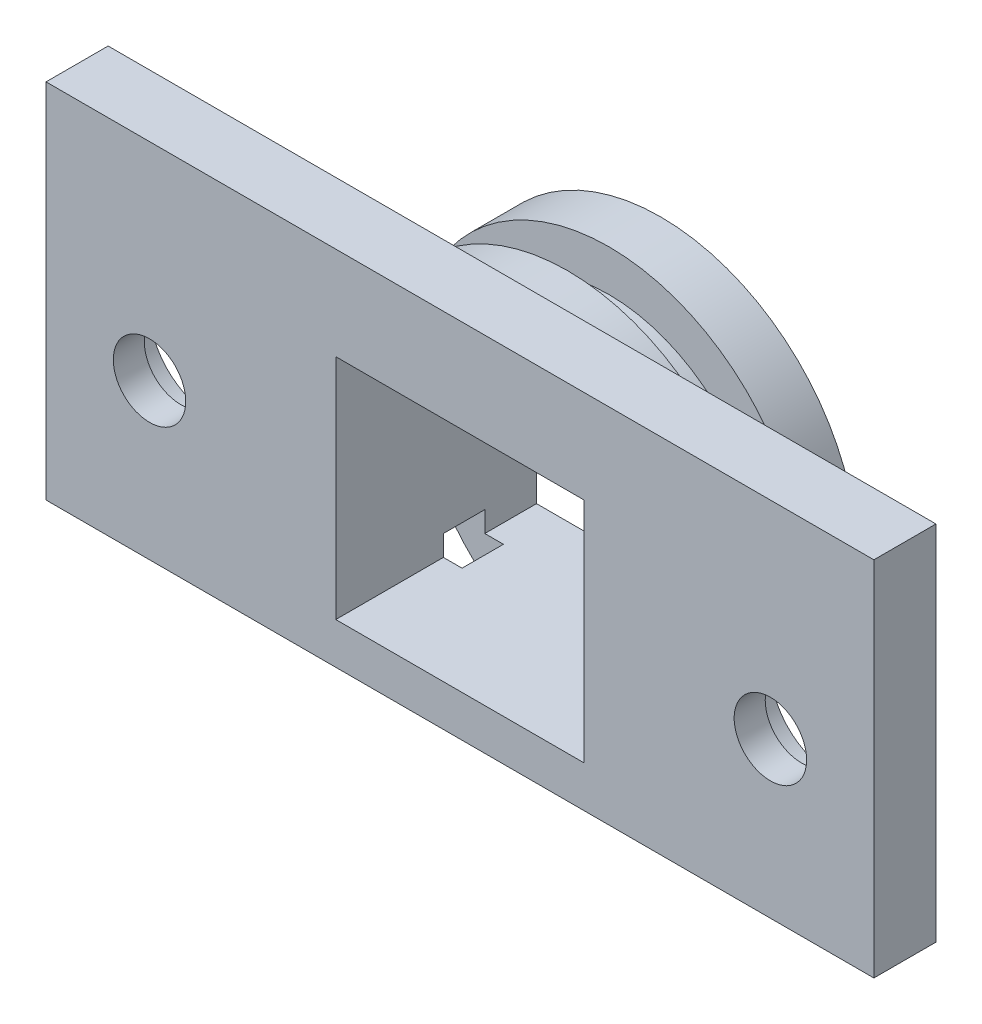
ISO-10303-21;
HEADER;
FILE_DESCRIPTION(('STEP AP214'),'2;1');
FILE_NAME('part.step','',(''),(''),'','','');
FILE_SCHEMA(('AUTOMOTIVE_DESIGN { 1 0 10303 214 1 1 1 1 }'));
ENDSEC;
DATA;
#1=APPLICATION_CONTEXT('core data for automotive mechanical design processes');
#2=APPLICATION_PROTOCOL_DEFINITION('international standard','automotive_design',2000,#1);
#3=PRODUCT_CONTEXT('',#1,'mechanical');
#4=PRODUCT('Part','Part','',(#3));
#5=PRODUCT_RELATED_PRODUCT_CATEGORY('part','',(#4));
#6=PRODUCT_DEFINITION_FORMATION('','',#4);
#7=PRODUCT_DEFINITION_CONTEXT('part definition',#1,'design');
#8=PRODUCT_DEFINITION('design','',#6,#7);
#9=PRODUCT_DEFINITION_SHAPE('','',#8);
#10=(LENGTH_UNIT() NAMED_UNIT(*) SI_UNIT(.MILLI.,.METRE.));
#11=(NAMED_UNIT(*) PLANE_ANGLE_UNIT() SI_UNIT($,.RADIAN.));
#12=(NAMED_UNIT(*) SI_UNIT($,.STERADIAN.) SOLID_ANGLE_UNIT());
#13=UNCERTAINTY_MEASURE_WITH_UNIT(LENGTH_MEASURE(1.E-05),#10,'distance_accuracy_value','');
#14=(GEOMETRIC_REPRESENTATION_CONTEXT(3) GLOBAL_UNCERTAINTY_ASSIGNED_CONTEXT((#13)) GLOBAL_UNIT_ASSIGNED_CONTEXT((#10,
#11,#12)) REPRESENTATION_CONTEXT('',''));
#15=CARTESIAN_POINT('',(0.,0.,0.));
#16=DIRECTION('',(0.,0.,1.));
#17=DIRECTION('',(1.,0.,0.));
#18=AXIS2_PLACEMENT_3D('',#15,#16,#17);
#19=CARTESIAN_POINT('',(15.,0.,-6.7));
#20=DIRECTION('',(0.,0.,1.));
#21=DIRECTION('',(1.,0.,0.));
#22=AXIS2_PLACEMENT_3D('',#19,#20,#21);
#23=CYLINDRICAL_SURFACE('',#22,1.75);
#24=CARTESIAN_POINT('',(15.,0.,3.));
#25=DIRECTION('',(0.,0.,1.));
#26=DIRECTION('',(1.,0.,0.));
#27=AXIS2_PLACEMENT_3D('',#24,#25,#26);
#28=CIRCLE('',#27,1.75);
#29=CARTESIAN_POINT('',(16.75,0.,3.));
#30=VERTEX_POINT('',#29);
#31=EDGE_CURVE('E362',#30,#30,#28,.T.);
#32=ORIENTED_EDGE('',*,*,#31,.T.);
#33=EDGE_LOOP('',(#32));
#34=FACE_BOUND('',#33,.T.);
#35=CARTESIAN_POINT('',(15.,0.,1.5));
#36=DIRECTION('',(0.,0.,-1.));
#37=DIRECTION('',(-1.,0.,0.));
#38=AXIS2_PLACEMENT_3D('',#35,#36,#37);
#39=CIRCLE('',#38,1.75);
#40=CARTESIAN_POINT('',(13.25,0.,1.5));
#41=VERTEX_POINT('',#40);
#42=EDGE_CURVE('E38',#41,#41,#39,.F.);
#43=ORIENTED_EDGE('',*,*,#42,.F.);
#44=EDGE_LOOP('',(#43));
#45=FACE_BOUND('',#44,.T.);
#46=ADVANCED_FACE('F34',(#34,#45),#23,.F.);
#47=CARTESIAN_POINT('',(-15.,0.,-6.7));
#48=DIRECTION('',(0.,0.,1.));
#49=DIRECTION('',(1.,0.,0.));
#50=AXIS2_PLACEMENT_3D('',#47,#48,#49);
#51=CYLINDRICAL_SURFACE('',#50,1.75);
#52=CARTESIAN_POINT('',(-15.,0.,3.));
#53=DIRECTION('',(0.,0.,1.));
#54=DIRECTION('',(1.,0.,0.));
#55=AXIS2_PLACEMENT_3D('',#52,#53,#54);
#56=CIRCLE('',#55,1.75);
#57=CARTESIAN_POINT('',(-13.25,0.,3.));
#58=VERTEX_POINT('',#57);
#59=EDGE_CURVE('E380',#58,#58,#56,.T.);
#60=ORIENTED_EDGE('',*,*,#59,.T.);
#61=EDGE_LOOP('',(#60));
#62=FACE_BOUND('',#61,.T.);
#63=CARTESIAN_POINT('',(-15.,0.,1.5));
#64=DIRECTION('',(0.,0.,-1.));
#65=DIRECTION('',(-1.,0.,0.));
#66=AXIS2_PLACEMENT_3D('',#63,#64,#65);
#67=CIRCLE('',#66,1.75);
#68=CARTESIAN_POINT('',(-16.75,0.,1.5));
#69=VERTEX_POINT('',#68);
#70=EDGE_CURVE('E356',#69,#69,#67,.F.);
#71=ORIENTED_EDGE('',*,*,#70,.F.);
#72=EDGE_LOOP('',(#71));
#73=FACE_BOUND('',#72,.T.);
#74=ADVANCED_FACE('F441',(#62,#73),#51,.F.);
#75=CARTESIAN_POINT('',(0.,0.,-2.2));
#76=DIRECTION('',(0.,0.,1.));
#77=DIRECTION('',(1.,0.,0.));
#78=AXIS2_PLACEMENT_3D('',#75,#76,#77);
#79=PLANE('',#78);
#80=DIRECTION('',(0.,-1.,0.));
#81=VECTOR('',#80,1.);
#82=CARTESIAN_POINT('',(6.,0.,-2.2));
#83=LINE('',#82,#81);
#84=CARTESIAN_POINT('',(6.,5.5,-2.2));
#85=VERTEX_POINT('',#84);
#86=CARTESIAN_POINT('',(6.,4.5,-2.2));
#87=VERTEX_POINT('',#86);
#88=EDGE_CURVE('E312',#85,#87,#83,.T.);
#89=ORIENTED_EDGE('',*,*,#88,.F.);
#90=DIRECTION('',(1.,0.,0.));
#91=VECTOR('',#90,1.);
#92=CARTESIAN_POINT('',(0.,5.5,-2.2));
#93=LINE('',#92,#91);
#94=CARTESIAN_POINT('',(5.09901951359279,5.5,-2.2));
#95=VERTEX_POINT('',#94);
#96=EDGE_CURVE('E304',#95,#85,#93,.T.);
#97=ORIENTED_EDGE('',*,*,#96,.F.);
#98=CARTESIAN_POINT('',(0.,0.,-2.2));
#99=DIRECTION('',(0.,0.,-1.));
#100=DIRECTION('',(-1.,0.,0.));
#101=AXIS2_PLACEMENT_3D('',#98,#99,#100);
#102=CIRCLE('',#101,7.5);
#103=CARTESIAN_POINT('',(-5.09901951359279,5.5,-2.2));
#104=VERTEX_POINT('',#103);
#105=EDGE_CURVE('E688',#104,#95,#102,.T.);
#106=ORIENTED_EDGE('',*,*,#105,.F.);
#107=CARTESIAN_POINT('',(-6.,5.5,-2.2));
#108=VERTEX_POINT('',#107);
#109=EDGE_CURVE('E302',#108,#104,#93,.T.);
#110=ORIENTED_EDGE('',*,*,#109,.F.);
#111=DIRECTION('',(0.,-1.,0.));
#112=VECTOR('',#111,1.);
#113=CARTESIAN_POINT('',(-6.,0.,-2.2));
#114=LINE('',#113,#112);
#115=CARTESIAN_POINT('',(-6.,4.5,-2.2));
#116=VERTEX_POINT('',#115);
#117=EDGE_CURVE('E289',#108,#116,#114,.T.);
#118=ORIENTED_EDGE('',*,*,#117,.T.);
#119=CARTESIAN_POINT('',(-6.,-4.5,-2.2));
#120=VERTEX_POINT('',#119);
#121=EDGE_CURVE('E345',#120,#116,#102,.T.);
#122=ORIENTED_EDGE('',*,*,#121,.F.);
#123=CARTESIAN_POINT('',(-6.,-5.5,-2.2));
#124=VERTEX_POINT('',#123);
#125=EDGE_CURVE('E292',#120,#124,#114,.T.);
#126=ORIENTED_EDGE('',*,*,#125,.T.);
#127=DIRECTION('',(1.,0.,0.));
#128=VECTOR('',#127,1.);
#129=CARTESIAN_POINT('',(0.,-5.5,-2.2));
#130=LINE('',#129,#128);
#131=CARTESIAN_POINT('',(-5.09901951359279,-5.5,-2.2));
#132=VERTEX_POINT('',#131);
#133=EDGE_CURVE('E275',#124,#132,#130,.T.);
#134=ORIENTED_EDGE('',*,*,#133,.T.);
#135=CARTESIAN_POINT('',(0.,-7.5,-2.2));
#136=VERTEX_POINT('',#135);
#137=EDGE_CURVE('E342',#136,#132,#102,.T.);
#138=ORIENTED_EDGE('',*,*,#137,.F.);
#139=DIRECTION('',(1.,0.,0.));
#140=VECTOR('',#139,1.);
#141=CARTESIAN_POINT('',(-5.8309518948453,-7.5,-2.2));
#142=LINE('',#141,#140);
#143=CARTESIAN_POINT('',(-5.8309518948453,-7.5,-2.2));
#144=VERTEX_POINT('',#143);
#145=EDGE_CURVE('E350',#144,#136,#142,.T.);
#146=ORIENTED_EDGE('',*,*,#145,.F.);
#147=CARTESIAN_POINT('',(0.,0.,-2.2));
#148=DIRECTION('',(0.,0.,1.));
#149=DIRECTION('',(1.,0.,0.));
#150=AXIS2_PLACEMENT_3D('',#147,#148,#149);
#151=CIRCLE('',#150,9.5);
#152=CARTESIAN_POINT('',(5.8309518948453,-7.5,-2.2));
#153=VERTEX_POINT('',#152);
#154=EDGE_CURVE('E346',#153,#144,#151,.T.);
#155=ORIENTED_EDGE('',*,*,#154,.F.);
#156=EDGE_CURVE('E349',#136,#153,#142,.T.);
#157=ORIENTED_EDGE('',*,*,#156,.F.);
#158=CARTESIAN_POINT('',(5.09901951359279,-5.5,-2.2));
#159=VERTEX_POINT('',#158);
#160=EDGE_CURVE('E335',#159,#136,#102,.T.);
#161=ORIENTED_EDGE('',*,*,#160,.F.);
#162=CARTESIAN_POINT('',(6.,-5.5,-2.2));
#163=VERTEX_POINT('',#162);
#164=EDGE_CURVE('E278',#159,#163,#130,.T.);
#165=ORIENTED_EDGE('',*,*,#164,.T.);
#166=CARTESIAN_POINT('',(6.,-4.5,-2.2));
#167=VERTEX_POINT('',#166);
#168=EDGE_CURVE('E314',#167,#163,#83,.T.);
#169=ORIENTED_EDGE('',*,*,#168,.F.);
#170=EDGE_CURVE('E415',#87,#167,#102,.T.);
#171=ORIENTED_EDGE('',*,*,#170,.F.);
#172=EDGE_LOOP('',(#89,#97,#106,#110,#118,#122,#126,#134,#138,#146,#155,#157,#161,#165,#169,#171));
#173=FACE_BOUND('',#172,.T.);
#174=ADVANCED_FACE('F406',(#173),#79,.F.);
#175=CARTESIAN_POINT('',(0.,0.,-4.2));
#176=DIRECTION('',(0.,0.,1.));
#177=DIRECTION('',(1.,0.,0.));
#178=AXIS2_PLACEMENT_3D('',#175,#176,#177);
#179=CYLINDRICAL_SURFACE('',#178,7.5);
#180=DIRECTION('',(0.,0.,1.));
#181=VECTOR('',#180,1.);
#182=CARTESIAN_POINT('',(6.,-4.5,-4.2));
#183=LINE('',#182,#181);
#184=CARTESIAN_POINT('',(6.,-4.5,-4.2));
#185=VERTEX_POINT('',#184);
#186=EDGE_CURVE('E315',#185,#167,#183,.T.);
#187=ORIENTED_EDGE('',*,*,#186,.F.);
#188=CARTESIAN_POINT('',(0.,0.,-4.2));
#189=DIRECTION('',(0.,0.,-1.));
#190=DIRECTION('',(-1.,0.,0.));
#191=AXIS2_PLACEMENT_3D('',#188,#189,#190);
#192=CIRCLE('',#191,7.5);
#193=CARTESIAN_POINT('',(6.,4.5,-4.2));
#194=VERTEX_POINT('',#193);
#195=EDGE_CURVE('E673',#194,#185,#192,.T.);
#196=ORIENTED_EDGE('',*,*,#195,.F.);
#197=DIRECTION('',(0.,0.,1.));
#198=VECTOR('',#197,1.);
#199=CARTESIAN_POINT('',(6.,4.5,-4.2));
#200=LINE('',#199,#198);
#201=EDGE_CURVE('E309',#87,#194,#200,.F.);
#202=ORIENTED_EDGE('',*,*,#201,.F.);
#203=ORIENTED_EDGE('',*,*,#170,.T.);
#204=EDGE_LOOP('',(#187,#196,#202,#203));
#205=FACE_BOUND('',#204,.T.);
#206=ADVANCED_FACE('F532',(#205),#179,.T.);
#207=DIRECTION('',(0.,0.,1.));
#208=VECTOR('',#207,1.);
#209=CARTESIAN_POINT('',(5.09901951359279,5.5,-4.2));
#210=LINE('',#209,#208);
#211=CARTESIAN_POINT('',(5.09901951359279,5.5,-4.2));
#212=VERTEX_POINT('',#211);
#213=EDGE_CURVE('E305',#212,#95,#210,.T.);
#214=ORIENTED_EDGE('',*,*,#213,.F.);
#215=CARTESIAN_POINT('',(-5.09901951359279,5.5,-4.2));
#216=VERTEX_POINT('',#215);
#217=EDGE_CURVE('E676',#216,#212,#192,.T.);
#218=ORIENTED_EDGE('',*,*,#217,.F.);
#219=DIRECTION('',(0.,0.,1.));
#220=VECTOR('',#219,1.);
#221=CARTESIAN_POINT('',(-5.09901951359279,5.5,-4.2));
#222=LINE('',#221,#220);
#223=EDGE_CURVE('E299',#104,#216,#222,.F.);
#224=ORIENTED_EDGE('',*,*,#223,.F.);
#225=ORIENTED_EDGE('',*,*,#105,.T.);
#226=EDGE_LOOP('',(#214,#218,#224,#225));
#227=FACE_BOUND('',#226,.T.);
#228=ADVANCED_FACE('F615',(#227),#179,.T.);
#229=CARTESIAN_POINT('',(-6.,-4.5,-4.2));
#230=VERTEX_POINT('',#229);
#231=CARTESIAN_POINT('',(-6.,4.5,-4.2));
#232=VERTEX_POINT('',#231);
#233=EDGE_CURVE('E340',#230,#232,#192,.T.);
#234=ORIENTED_EDGE('',*,*,#233,.F.);
#235=DIRECTION('',(0.,0.,1.));
#236=VECTOR('',#235,1.);
#237=CARTESIAN_POINT('',(-6.,-4.5,-4.2));
#238=LINE('',#237,#236);
#239=EDGE_CURVE('E293',#230,#120,#238,.T.);
#240=ORIENTED_EDGE('',*,*,#239,.T.);
#241=ORIENTED_EDGE('',*,*,#121,.T.);
#242=DIRECTION('',(0.,0.,1.));
#243=VECTOR('',#242,1.);
#244=CARTESIAN_POINT('',(-6.,4.5,-4.2));
#245=LINE('',#244,#243);
#246=EDGE_CURVE('E285',#116,#232,#245,.F.);
#247=ORIENTED_EDGE('',*,*,#246,.T.);
#248=EDGE_LOOP('',(#234,#240,#241,#247));
#249=FACE_BOUND('',#248,.T.);
#250=ADVANCED_FACE('F533',(#249),#179,.T.);
#251=CARTESIAN_POINT('',(0.,0.,-4.2));
#252=DIRECTION('',(0.,0.,-1.));
#253=DIRECTION('',(-1.,0.,0.));
#254=AXIS2_PLACEMENT_3D('',#251,#252,#253);
#255=PLANE('',#254);
#256=DIRECTION('',(0.,1.,0.));
#257=VECTOR('',#256,1.);
#258=CARTESIAN_POINT('',(6.,0.,-4.2));
#259=LINE('',#258,#257);
#260=CARTESIAN_POINT('',(6.,5.5,-4.2));
#261=VERTEX_POINT('',#260);
#262=EDGE_CURVE('E307',#194,#261,#259,.T.);
#263=ORIENTED_EDGE('',*,*,#262,.F.);
#264=ORIENTED_EDGE('',*,*,#195,.T.);
#265=CARTESIAN_POINT('',(6.,-5.5,-4.2));
#266=VERTEX_POINT('',#265);
#267=EDGE_CURVE('E310',#266,#185,#259,.T.);
#268=ORIENTED_EDGE('',*,*,#267,.F.);
#269=DIRECTION('',(-1.,0.,0.));
#270=VECTOR('',#269,1.);
#271=CARTESIAN_POINT('',(0.,-5.5,-4.2));
#272=LINE('',#271,#270);
#273=CARTESIAN_POINT('',(5.09901951359279,-5.5,-4.2));
#274=VERTEX_POINT('',#273);
#275=EDGE_CURVE('E272',#266,#274,#272,.T.);
#276=ORIENTED_EDGE('',*,*,#275,.T.);
#277=CARTESIAN_POINT('',(0.,-7.5,-4.2));
#278=VERTEX_POINT('',#277);
#279=EDGE_CURVE('E341',#274,#278,#192,.T.);
#280=ORIENTED_EDGE('',*,*,#279,.T.);
#281=DIRECTION('',(-1.,0.,0.));
#282=VECTOR('',#281,1.);
#283=CARTESIAN_POINT('',(5.8309518948453,-7.5,-4.2));
#284=LINE('',#283,#282);
#285=CARTESIAN_POINT('',(5.8309518948453,-7.5,-4.2));
#286=VERTEX_POINT('',#285);
#287=EDGE_CURVE('E321',#286,#278,#284,.T.);
#288=ORIENTED_EDGE('',*,*,#287,.F.);
#289=CARTESIAN_POINT('',(0.,0.,-4.2));
#290=DIRECTION('',(0.,0.,-1.));
#291=DIRECTION('',(-1.,0.,0.));
#292=AXIS2_PLACEMENT_3D('',#289,#290,#291);
#293=CIRCLE('',#292,9.5);
#294=CARTESIAN_POINT('',(-5.8309518948453,-7.5,-4.2));
#295=VERTEX_POINT('',#294);
#296=EDGE_CURVE('E324',#295,#286,#293,.T.);
#297=ORIENTED_EDGE('',*,*,#296,.F.);
#298=EDGE_CURVE('E327',#278,#295,#284,.T.);
#299=ORIENTED_EDGE('',*,*,#298,.F.);
#300=CARTESIAN_POINT('',(-5.09901951359279,-5.5,-4.2));
#301=VERTEX_POINT('',#300);
#302=EDGE_CURVE('E336',#278,#301,#192,.T.);
#303=ORIENTED_EDGE('',*,*,#302,.T.);
#304=CARTESIAN_POINT('',(-6.,-5.5,-4.2));
#305=VERTEX_POINT('',#304);
#306=EDGE_CURVE('E268',#301,#305,#272,.T.);
#307=ORIENTED_EDGE('',*,*,#306,.T.);
#308=DIRECTION('',(0.,1.,0.));
#309=VECTOR('',#308,1.);
#310=CARTESIAN_POINT('',(-6.,0.,-4.2));
#311=LINE('',#310,#309);
#312=EDGE_CURVE('E286',#305,#230,#311,.T.);
#313=ORIENTED_EDGE('',*,*,#312,.T.);
#314=ORIENTED_EDGE('',*,*,#233,.T.);
#315=CARTESIAN_POINT('',(-6.,5.5,-4.2));
#316=VERTEX_POINT('',#315);
#317=EDGE_CURVE('E282',#232,#316,#311,.T.);
#318=ORIENTED_EDGE('',*,*,#317,.T.);
#319=DIRECTION('',(-1.,0.,0.));
#320=VECTOR('',#319,1.);
#321=CARTESIAN_POINT('',(0.,5.5,-4.2));
#322=LINE('',#321,#320);
#323=EDGE_CURVE('E296',#216,#316,#322,.T.);
#324=ORIENTED_EDGE('',*,*,#323,.F.);
#325=ORIENTED_EDGE('',*,*,#217,.T.);
#326=EDGE_CURVE('E300',#261,#212,#322,.T.);
#327=ORIENTED_EDGE('',*,*,#326,.F.);
#328=EDGE_LOOP('',(#263,#264,#268,#276,#280,#288,#297,#299,#303,#307,#313,#314,#318,#324,#325,#327));
#329=FACE_BOUND('',#328,.T.);
#330=ADVANCED_FACE('F595',(#329),#255,.F.);
#331=CARTESIAN_POINT('',(0.,0.,-6.7));
#332=DIRECTION('',(0.,0.,-1.));
#333=DIRECTION('',(-1.,0.,0.));
#334=AXIS2_PLACEMENT_3D('',#331,#332,#333);
#335=PLANE('',#334);
#336=CARTESIAN_POINT('',(0.,0.,-6.7));
#337=DIRECTION('',(0.,0.,-1.));
#338=DIRECTION('',(-1.,0.,0.));
#339=AXIS2_PLACEMENT_3D('',#336,#337,#338);
#340=CIRCLE('',#339,9.5);
#341=CARTESIAN_POINT('',(-5.8309518948453,-7.5,-6.7));
#342=VERTEX_POINT('',#341);
#343=CARTESIAN_POINT('',(5.8309518948453,-7.5,-6.7));
#344=VERTEX_POINT('',#343);
#345=EDGE_CURVE('E317',#342,#344,#340,.T.);
#346=ORIENTED_EDGE('',*,*,#345,.T.);
#347=DIRECTION('',(-1.,0.,0.));
#348=VECTOR('',#347,1.);
#349=CARTESIAN_POINT('',(5.8309518948453,-7.5,-6.7));
#350=LINE('',#349,#348);
#351=EDGE_CURVE('E320',#344,#342,#350,.T.);
#352=ORIENTED_EDGE('',*,*,#351,.T.);
#353=EDGE_LOOP('',(#346,#352));
#354=FACE_BOUND('',#353,.T.);
#355=DIRECTION('',(-1.,0.,0.));
#356=VECTOR('',#355,1.);
#357=CARTESIAN_POINT('',(6.,-5.5,-6.7));
#358=LINE('',#357,#356);
#359=CARTESIAN_POINT('',(6.,-5.5,-6.7));
#360=VERTEX_POINT('',#359);
#361=CARTESIAN_POINT('',(-6.,-5.5,-6.7));
#362=VERTEX_POINT('',#361);
#363=EDGE_CURVE('E250',#360,#362,#358,.T.);
#364=ORIENTED_EDGE('',*,*,#363,.F.);
#365=DIRECTION('',(0.,1.,0.));
#366=VECTOR('',#365,1.);
#367=CARTESIAN_POINT('',(6.,-5.5,-6.7));
#368=LINE('',#367,#366);
#369=CARTESIAN_POINT('',(6.,5.5,-6.7));
#370=VERTEX_POINT('',#369);
#371=EDGE_CURVE('E241',#360,#370,#368,.T.);
#372=ORIENTED_EDGE('',*,*,#371,.T.);
#373=DIRECTION('',(-1.,0.,0.));
#374=VECTOR('',#373,1.);
#375=CARTESIAN_POINT('',(6.,5.5,-6.7));
#376=LINE('',#375,#374);
#377=CARTESIAN_POINT('',(-6.,5.5,-6.7));
#378=VERTEX_POINT('',#377);
#379=EDGE_CURVE('E244',#370,#378,#376,.T.);
#380=ORIENTED_EDGE('',*,*,#379,.T.);
#381=DIRECTION('',(0.,1.,0.));
#382=VECTOR('',#381,1.);
#383=CARTESIAN_POINT('',(-6.,-5.5,-6.7));
#384=LINE('',#383,#382);
#385=EDGE_CURVE('E247',#362,#378,#384,.T.);
#386=ORIENTED_EDGE('',*,*,#385,.F.);
#387=EDGE_LOOP('',(#364,#372,#380,#386));
#388=FACE_BOUND('',#387,.T.);
#389=ADVANCED_FACE('F515',(#354,#388),#335,.T.);
#390=CARTESIAN_POINT('',(0.,0.,-2.2));
#391=DIRECTION('',(0.,0.,1.));
#392=DIRECTION('',(1.,0.,0.));
#393=AXIS2_PLACEMENT_3D('',#390,#391,#392);
#394=CYLINDRICAL_SURFACE('',#393,9.5);
#395=CARTESIAN_POINT('',(0.,0.,0.));
#396=DIRECTION('',(0.,0.,1.));
#397=DIRECTION('',(1.,0.,0.));
#398=AXIS2_PLACEMENT_3D('',#395,#396,#397);
#399=CIRCLE('',#398,9.5);
#400=CARTESIAN_POINT('',(5.8309518948453,-7.50000000000001,0.));
#401=VERTEX_POINT('',#400);
#402=CARTESIAN_POINT('',(-5.8309518948453,-7.50000000000001,0.));
#403=VERTEX_POINT('',#402);
#404=EDGE_CURVE('E339',#401,#403,#399,.T.);
#405=ORIENTED_EDGE('',*,*,#404,.F.);
#406=DIRECTION('',(0.,0.,1.));
#407=VECTOR('',#406,1.);
#408=CARTESIAN_POINT('',(5.8309518948453,-7.5,-2.2));
#409=LINE('',#408,#407);
#410=EDGE_CURVE('E11',#153,#401,#409,.T.);
#411=ORIENTED_EDGE('',*,*,#410,.F.);
#412=ORIENTED_EDGE('',*,*,#154,.T.);
#413=DIRECTION('',(0.,0.,1.));
#414=VECTOR('',#413,1.);
#415=CARTESIAN_POINT('',(-5.8309518948453,-7.5,-2.2));
#416=LINE('',#415,#414);
#417=EDGE_CURVE('E43',#144,#403,#416,.T.);
#418=ORIENTED_EDGE('',*,*,#417,.T.);
#419=EDGE_LOOP('',(#405,#411,#412,#418));
#420=FACE_BOUND('',#419,.T.);
#421=ADVANCED_FACE('F36',(#420),#394,.T.);
#422=CARTESIAN_POINT('',(-5.8309518948453,-7.5,-2.2));
#423=DIRECTION('',(0.,-1.,0.));
#424=DIRECTION('',(0.,0.,-1.));
#425=AXIS2_PLACEMENT_3D('',#422,#423,#424);
#426=PLANE('',#425);
#427=ORIENTED_EDGE('',*,*,#410,.T.);
#428=DIRECTION('',(1.,0.,0.));
#429=VECTOR('',#428,1.);
#430=CARTESIAN_POINT('',(0.,-7.50000000000001,0.));
#431=LINE('',#430,#429);
#432=CARTESIAN_POINT('',(20.,-7.50000000000001,0.));
#433=VERTEX_POINT('',#432);
#434=EDGE_CURVE('E203',#401,#433,#431,.T.);
#435=ORIENTED_EDGE('',*,*,#434,.T.);
#436=DIRECTION('',(0.,0.,-1.));
#437=VECTOR('',#436,1.);
#438=CARTESIAN_POINT('',(20.,-7.50000000000001,3.));
#439=LINE('',#438,#437);
#440=CARTESIAN_POINT('',(20.,-7.50000000000001,3.));
#441=VERTEX_POINT('',#440);
#442=EDGE_CURVE('E201',#441,#433,#439,.T.);
#443=ORIENTED_EDGE('',*,*,#442,.F.);
#444=DIRECTION('',(1.,0.,0.));
#445=VECTOR('',#444,1.);
#446=CARTESIAN_POINT('',(-20.,-7.5,3.));
#447=LINE('',#446,#445);
#448=CARTESIAN_POINT('',(-20.,-7.5,3.));
#449=VERTEX_POINT('',#448);
#450=EDGE_CURVE('E51',#449,#441,#447,.T.);
#451=ORIENTED_EDGE('',*,*,#450,.F.);
#452=DIRECTION('',(0.,0.,-1.));
#453=VECTOR('',#452,1.);
#454=CARTESIAN_POINT('',(-20.,-7.5,3.));
#455=LINE('',#454,#453);
#456=CARTESIAN_POINT('',(-20.,-7.5,0.));
#457=VERTEX_POINT('',#456);
#458=EDGE_CURVE('E207',#449,#457,#455,.T.);
#459=ORIENTED_EDGE('',*,*,#458,.T.);
#460=EDGE_CURVE('E379',#457,#403,#431,.T.);
#461=ORIENTED_EDGE('',*,*,#460,.T.);
#462=ORIENTED_EDGE('',*,*,#417,.F.);
#463=ORIENTED_EDGE('',*,*,#145,.T.);
#464=ORIENTED_EDGE('',*,*,#156,.T.);
#465=EDGE_LOOP('',(#427,#435,#443,#451,#459,#461,#462,#463,#464));
#466=FACE_BOUND('',#465,.T.);
#467=ADVANCED_FACE('F202',(#466),#426,.T.);
#468=ORIENTED_EDGE('',*,*,#302,.F.);
#469=ORIENTED_EDGE('',*,*,#279,.F.);
#470=DIRECTION('',(0.,0.,1.));
#471=VECTOR('',#470,1.);
#472=CARTESIAN_POINT('',(5.09901951359279,-5.5,-4.2));
#473=LINE('',#472,#471);
#474=EDGE_CURVE('E279',#274,#159,#473,.T.);
#475=ORIENTED_EDGE('',*,*,#474,.T.);
#476=ORIENTED_EDGE('',*,*,#160,.T.);
#477=ORIENTED_EDGE('',*,*,#137,.T.);
#478=DIRECTION('',(0.,0.,1.));
#479=VECTOR('',#478,1.);
#480=CARTESIAN_POINT('',(-5.09901951359279,-5.5,-4.2));
#481=LINE('',#480,#479);
#482=EDGE_CURVE('E271',#132,#301,#481,.F.);
#483=ORIENTED_EDGE('',*,*,#482,.T.);
#484=EDGE_LOOP('',(#468,#469,#475,#476,#477,#483));
#485=FACE_BOUND('',#484,.T.);
#486=ADVANCED_FACE('F411',(#485),#179,.T.);
#487=CARTESIAN_POINT('',(0.,0.,-6.7));
#488=DIRECTION('',(0.,0.,1.));
#489=DIRECTION('',(1.,0.,0.));
#490=AXIS2_PLACEMENT_3D('',#487,#488,#489);
#491=CYLINDRICAL_SURFACE('',#490,9.5);
#492=ORIENTED_EDGE('',*,*,#296,.T.);
#493=DIRECTION('',(0.,0.,1.));
#494=VECTOR('',#493,1.);
#495=CARTESIAN_POINT('',(5.8309518948453,-7.5,-6.7));
#496=LINE('',#495,#494);
#497=EDGE_CURVE('E332',#344,#286,#496,.T.);
#498=ORIENTED_EDGE('',*,*,#497,.F.);
#499=ORIENTED_EDGE('',*,*,#345,.F.);
#500=DIRECTION('',(0.,0.,1.));
#501=VECTOR('',#500,1.);
#502=CARTESIAN_POINT('',(-5.8309518948453,-7.5,-6.7));
#503=LINE('',#502,#501);
#504=EDGE_CURVE('E323',#342,#295,#503,.T.);
#505=ORIENTED_EDGE('',*,*,#504,.T.);
#506=EDGE_LOOP('',(#492,#498,#499,#505));
#507=FACE_BOUND('',#506,.T.);
#508=ADVANCED_FACE('F530',(#507),#491,.T.);
#509=CARTESIAN_POINT('',(5.8309518948453,-7.5,-6.7));
#510=DIRECTION('',(0.,1.,0.));
#511=DIRECTION('',(0.,0.,1.));
#512=AXIS2_PLACEMENT_3D('',#509,#510,#511);
#513=PLANE('',#512);
#514=ORIENTED_EDGE('',*,*,#287,.T.);
#515=ORIENTED_EDGE('',*,*,#298,.T.);
#516=ORIENTED_EDGE('',*,*,#504,.F.);
#517=ORIENTED_EDGE('',*,*,#351,.F.);
#518=ORIENTED_EDGE('',*,*,#497,.T.);
#519=EDGE_LOOP('',(#514,#515,#516,#517,#518));
#520=FACE_BOUND('',#519,.T.);
#521=ADVANCED_FACE('F582',(#520),#513,.F.);
#522=CARTESIAN_POINT('',(6.,-5.5,0.));
#523=DIRECTION('',(-1.,0.,0.));
#524=DIRECTION('',(0.,0.,1.));
#525=AXIS2_PLACEMENT_3D('',#522,#523,#524);
#526=PLANE('',#525);
#527=ORIENTED_EDGE('',*,*,#168,.T.);
#528=DIRECTION('',(0.,0.,-1.));
#529=VECTOR('',#528,1.);
#530=CARTESIAN_POINT('',(6.,-5.5,0.));
#531=LINE('',#530,#529);
#532=CARTESIAN_POINT('',(6.,-5.5,3.));
#533=VERTEX_POINT('',#532);
#534=EDGE_CURVE('E254',#533,#163,#531,.T.);
#535=ORIENTED_EDGE('',*,*,#534,.F.);
#536=DIRECTION('',(0.,1.,0.));
#537=VECTOR('',#536,1.);
#538=CARTESIAN_POINT('',(6.,-5.5,3.));
#539=LINE('',#538,#537);
#540=CARTESIAN_POINT('',(6.,5.5,3.));
#541=VERTEX_POINT('',#540);
#542=EDGE_CURVE('E388',#533,#541,#539,.T.);
#543=ORIENTED_EDGE('',*,*,#542,.T.);
#544=DIRECTION('',(0.,0.,-1.));
#545=VECTOR('',#544,1.);
#546=CARTESIAN_POINT('',(6.,5.5,0.));
#547=LINE('',#546,#545);
#548=EDGE_CURVE('E265',#541,#85,#547,.T.);
#549=ORIENTED_EDGE('',*,*,#548,.T.);
#550=ORIENTED_EDGE('',*,*,#88,.T.);
#551=ORIENTED_EDGE('',*,*,#201,.T.);
#552=ORIENTED_EDGE('',*,*,#262,.T.);
#553=EDGE_CURVE('E59',#261,#370,#547,.T.);
#554=ORIENTED_EDGE('',*,*,#553,.T.);
#555=ORIENTED_EDGE('',*,*,#371,.F.);
#556=EDGE_CURVE('E253',#266,#360,#531,.T.);
#557=ORIENTED_EDGE('',*,*,#556,.F.);
#558=ORIENTED_EDGE('',*,*,#267,.T.);
#559=ORIENTED_EDGE('',*,*,#186,.T.);
#560=EDGE_LOOP('',(#527,#535,#543,#549,#550,#551,#552,#554,#555,#557,#558,#559));
#561=FACE_BOUND('',#560,.T.);
#562=ADVANCED_FACE('F572',(#561),#526,.T.);
#563=CARTESIAN_POINT('',(6.,5.5,0.));
#564=DIRECTION('',(0.,-1.,0.));
#565=DIRECTION('',(0.,0.,-1.));
#566=AXIS2_PLACEMENT_3D('',#563,#564,#565);
#567=PLANE('',#566);
#568=ORIENTED_EDGE('',*,*,#96,.T.);
#569=ORIENTED_EDGE('',*,*,#548,.F.);
#570=DIRECTION('',(-1.,0.,0.));
#571=VECTOR('',#570,1.);
#572=CARTESIAN_POINT('',(6.,5.5,3.));
#573=LINE('',#572,#571);
#574=CARTESIAN_POINT('',(-6.,5.5,3.));
#575=VERTEX_POINT('',#574);
#576=EDGE_CURVE('E390',#541,#575,#573,.T.);
#577=ORIENTED_EDGE('',*,*,#576,.T.);
#578=DIRECTION('',(0.,0.,-1.));
#579=VECTOR('',#578,1.);
#580=CARTESIAN_POINT('',(-6.,5.5,0.));
#581=LINE('',#580,#579);
#582=EDGE_CURVE('E262',#575,#108,#581,.T.);
#583=ORIENTED_EDGE('',*,*,#582,.T.);
#584=ORIENTED_EDGE('',*,*,#109,.T.);
#585=ORIENTED_EDGE('',*,*,#223,.T.);
#586=ORIENTED_EDGE('',*,*,#323,.T.);
#587=EDGE_CURVE('E261',#316,#378,#581,.T.);
#588=ORIENTED_EDGE('',*,*,#587,.T.);
#589=ORIENTED_EDGE('',*,*,#379,.F.);
#590=ORIENTED_EDGE('',*,*,#553,.F.);
#591=ORIENTED_EDGE('',*,*,#326,.T.);
#592=ORIENTED_EDGE('',*,*,#213,.T.);
#593=EDGE_LOOP('',(#568,#569,#577,#583,#584,#585,#586,#588,#589,#590,#591,#592));
#594=FACE_BOUND('',#593,.T.);
#595=ADVANCED_FACE('F562',(#594),#567,.T.);
#596=CARTESIAN_POINT('',(-6.,-5.5,0.));
#597=DIRECTION('',(-1.,0.,0.));
#598=DIRECTION('',(0.,0.,1.));
#599=AXIS2_PLACEMENT_3D('',#596,#597,#598);
#600=PLANE('',#599);
#601=ORIENTED_EDGE('',*,*,#239,.F.);
#602=ORIENTED_EDGE('',*,*,#312,.F.);
#603=DIRECTION('',(0.,0.,-1.));
#604=VECTOR('',#603,1.);
#605=CARTESIAN_POINT('',(-6.,-5.5,0.));
#606=LINE('',#605,#604);
#607=EDGE_CURVE('E257',#305,#362,#606,.T.);
#608=ORIENTED_EDGE('',*,*,#607,.T.);
#609=ORIENTED_EDGE('',*,*,#385,.T.);
#610=ORIENTED_EDGE('',*,*,#587,.F.);
#611=ORIENTED_EDGE('',*,*,#317,.F.);
#612=ORIENTED_EDGE('',*,*,#246,.F.);
#613=ORIENTED_EDGE('',*,*,#117,.F.);
#614=ORIENTED_EDGE('',*,*,#582,.F.);
#615=DIRECTION('',(0.,-1.,0.));
#616=VECTOR('',#615,1.);
#617=CARTESIAN_POINT('',(-6.,-5.5,3.));
#618=LINE('',#617,#616);
#619=CARTESIAN_POINT('',(-6.,-5.5,3.));
#620=VERTEX_POINT('',#619);
#621=EDGE_CURVE('E230',#575,#620,#618,.T.);
#622=ORIENTED_EDGE('',*,*,#621,.T.);
#623=EDGE_CURVE('E258',#620,#124,#606,.T.);
#624=ORIENTED_EDGE('',*,*,#623,.T.);
#625=ORIENTED_EDGE('',*,*,#125,.F.);
#626=EDGE_LOOP('',(#601,#602,#608,#609,#610,#611,#612,#613,#614,#622,#624,#625));
#627=FACE_BOUND('',#626,.T.);
#628=ADVANCED_FACE('F397',(#627),#600,.F.);
#629=CARTESIAN_POINT('',(6.,-5.5,0.));
#630=DIRECTION('',(0.,-1.,0.));
#631=DIRECTION('',(0.,0.,-1.));
#632=AXIS2_PLACEMENT_3D('',#629,#630,#631);
#633=PLANE('',#632);
#634=ORIENTED_EDGE('',*,*,#474,.F.);
#635=ORIENTED_EDGE('',*,*,#275,.F.);
#636=ORIENTED_EDGE('',*,*,#556,.T.);
#637=ORIENTED_EDGE('',*,*,#363,.T.);
#638=ORIENTED_EDGE('',*,*,#607,.F.);
#639=ORIENTED_EDGE('',*,*,#306,.F.);
#640=ORIENTED_EDGE('',*,*,#482,.F.);
#641=ORIENTED_EDGE('',*,*,#133,.F.);
#642=ORIENTED_EDGE('',*,*,#623,.F.);
#643=DIRECTION('',(1.,0.,0.));
#644=VECTOR('',#643,1.);
#645=CARTESIAN_POINT('',(6.,-5.5,3.));
#646=LINE('',#645,#644);
#647=EDGE_CURVE('E383',#620,#533,#646,.T.);
#648=ORIENTED_EDGE('',*,*,#647,.T.);
#649=ORIENTED_EDGE('',*,*,#534,.T.);
#650=ORIENTED_EDGE('',*,*,#164,.F.);
#651=EDGE_LOOP('',(#634,#635,#636,#637,#638,#639,#640,#641,#642,#648,#649,#650));
#652=FACE_BOUND('',#651,.T.);
#653=ADVANCED_FACE('F401',(#652),#633,.F.);
#654=CARTESIAN_POINT('',(0.,0.,3.));
#655=DIRECTION('',(0.,0.,-1.));
#656=DIRECTION('',(-1.,0.,0.));
#657=AXIS2_PLACEMENT_3D('',#654,#655,#656);
#658=PLANE('',#657);
#659=ORIENTED_EDGE('',*,*,#59,.F.);
#660=EDGE_LOOP('',(#659));
#661=FACE_BOUND('',#660,.T.);
#662=ORIENTED_EDGE('',*,*,#31,.F.);
#663=EDGE_LOOP('',(#662));
#664=FACE_BOUND('',#663,.T.);
#665=DIRECTION('',(0.,-1.,0.));
#666=VECTOR('',#665,1.);
#667=CARTESIAN_POINT('',(-20.,-10.,3.));
#668=LINE('',#667,#666);
#669=CARTESIAN_POINT('',(-20.,10.,3.));
#670=VERTEX_POINT('',#669);
#671=EDGE_CURVE('E216',#670,#449,#668,.T.);
#672=ORIENTED_EDGE('',*,*,#671,.T.);
#673=ORIENTED_EDGE('',*,*,#450,.T.);
#674=DIRECTION('',(0.,1.,0.));
#675=VECTOR('',#674,1.);
#676=CARTESIAN_POINT('',(20.,-10.,3.));
#677=LINE('',#676,#675);
#678=CARTESIAN_POINT('',(20.,10.,3.));
#679=VERTEX_POINT('',#678);
#680=EDGE_CURVE('E213',#441,#679,#677,.T.);
#681=ORIENTED_EDGE('',*,*,#680,.T.);
#682=DIRECTION('',(-1.,0.,0.));
#683=VECTOR('',#682,1.);
#684=CARTESIAN_POINT('',(-20.,10.,3.));
#685=LINE('',#684,#683);
#686=EDGE_CURVE('E222',#679,#670,#685,.T.);
#687=ORIENTED_EDGE('',*,*,#686,.T.);
#688=EDGE_LOOP('',(#672,#673,#681,#687));
#689=FACE_BOUND('',#688,.T.);
#690=ORIENTED_EDGE('',*,*,#647,.F.);
#691=ORIENTED_EDGE('',*,*,#621,.F.);
#692=ORIENTED_EDGE('',*,*,#576,.F.);
#693=ORIENTED_EDGE('',*,*,#542,.F.);
#694=EDGE_LOOP('',(#690,#691,#692,#693));
#695=FACE_BOUND('',#694,.T.);
#696=ADVANCED_FACE('F211',(#661,#664,#689,#695),#658,.F.);
#697=CARTESIAN_POINT('',(0.,0.,0.));
#698=DIRECTION('',(0.,0.,-1.));
#699=DIRECTION('',(-1.,0.,0.));
#700=AXIS2_PLACEMENT_3D('',#697,#698,#699);
#701=PLANE('',#700);
#702=ORIENTED_EDGE('',*,*,#460,.F.);
#703=DIRECTION('',(0.,-1.,0.));
#704=VECTOR('',#703,1.);
#705=CARTESIAN_POINT('',(-20.,-10.,0.));
#706=LINE('',#705,#704);
#707=CARTESIAN_POINT('',(-20.,10.,0.));
#708=VERTEX_POINT('',#707);
#709=EDGE_CURVE('E223',#708,#457,#706,.T.);
#710=ORIENTED_EDGE('',*,*,#709,.F.);
#711=DIRECTION('',(-1.,0.,0.));
#712=VECTOR('',#711,1.);
#713=CARTESIAN_POINT('',(-20.,10.,0.));
#714=LINE('',#713,#712);
#715=CARTESIAN_POINT('',(20.,10.,0.));
#716=VERTEX_POINT('',#715);
#717=EDGE_CURVE('E227',#716,#708,#714,.T.);
#718=ORIENTED_EDGE('',*,*,#717,.F.);
#719=DIRECTION('',(0.,1.,0.));
#720=VECTOR('',#719,1.);
#721=CARTESIAN_POINT('',(20.,-10.,0.));
#722=LINE('',#721,#720);
#723=EDGE_CURVE('E235',#433,#716,#722,.T.);
#724=ORIENTED_EDGE('',*,*,#723,.F.);
#725=ORIENTED_EDGE('',*,*,#434,.F.);
#726=ORIENTED_EDGE('',*,*,#404,.T.);
#727=EDGE_LOOP('',(#702,#710,#718,#724,#725,#726));
#728=FACE_BOUND('',#727,.T.);
#729=CARTESIAN_POINT('',(-15.,0.,0.));
#730=DIRECTION('',(0.,0.,-1.));
#731=DIRECTION('',(-1.,0.,0.));
#732=AXIS2_PLACEMENT_3D('',#729,#730,#731);
#733=CIRCLE('',#732,3.);
#734=CARTESIAN_POINT('',(-18.,0.,0.));
#735=VERTEX_POINT('',#734);
#736=EDGE_CURVE('E364',#735,#735,#733,.T.);
#737=ORIENTED_EDGE('',*,*,#736,.F.);
#738=EDGE_LOOP('',(#737));
#739=FACE_BOUND('',#738,.T.);
#740=CARTESIAN_POINT('',(15.,0.,0.));
#741=DIRECTION('',(0.,0.,-1.));
#742=DIRECTION('',(-1.,0.,0.));
#743=AXIS2_PLACEMENT_3D('',#740,#741,#742);
#744=CIRCLE('',#743,3.);
#745=CARTESIAN_POINT('',(12.,0.,0.));
#746=VERTEX_POINT('',#745);
#747=EDGE_CURVE('E376',#746,#746,#744,.T.);
#748=ORIENTED_EDGE('',*,*,#747,.F.);
#749=EDGE_LOOP('',(#748));
#750=FACE_BOUND('',#749,.T.);
#751=ADVANCED_FACE('F422',(#728,#739,#750),#701,.T.);
#752=CARTESIAN_POINT('',(20.,-10.,3.));
#753=DIRECTION('',(-1.,0.,0.));
#754=DIRECTION('',(0.,0.,1.));
#755=AXIS2_PLACEMENT_3D('',#752,#753,#754);
#756=PLANE('',#755);
#757=ORIENTED_EDGE('',*,*,#680,.F.);
#758=ORIENTED_EDGE('',*,*,#442,.T.);
#759=ORIENTED_EDGE('',*,*,#723,.T.);
#760=DIRECTION('',(0.,0.,-1.));
#761=VECTOR('',#760,1.);
#762=CARTESIAN_POINT('',(20.,10.,3.));
#763=LINE('',#762,#761);
#764=EDGE_CURVE('E221',#679,#716,#763,.T.);
#765=ORIENTED_EDGE('',*,*,#764,.F.);
#766=EDGE_LOOP('',(#757,#758,#759,#765));
#767=FACE_BOUND('',#766,.T.);
#768=ADVANCED_FACE('F219',(#767),#756,.F.);
#769=CARTESIAN_POINT('',(-20.,10.,3.));
#770=DIRECTION('',(0.,-1.,0.));
#771=DIRECTION('',(0.,0.,-1.));
#772=AXIS2_PLACEMENT_3D('',#769,#770,#771);
#773=PLANE('',#772);
#774=ORIENTED_EDGE('',*,*,#717,.T.);
#775=DIRECTION('',(0.,0.,-1.));
#776=VECTOR('',#775,1.);
#777=CARTESIAN_POINT('',(-20.,10.,3.));
#778=LINE('',#777,#776);
#779=EDGE_CURVE('E234',#670,#708,#778,.T.);
#780=ORIENTED_EDGE('',*,*,#779,.F.);
#781=ORIENTED_EDGE('',*,*,#686,.F.);
#782=ORIENTED_EDGE('',*,*,#764,.T.);
#783=EDGE_LOOP('',(#774,#780,#781,#782));
#784=FACE_BOUND('',#783,.T.);
#785=ADVANCED_FACE('F430',(#784),#773,.F.);
#786=CARTESIAN_POINT('',(-20.,-10.,3.));
#787=DIRECTION('',(1.,0.,0.));
#788=DIRECTION('',(0.,0.,-1.));
#789=AXIS2_PLACEMENT_3D('',#786,#787,#788);
#790=PLANE('',#789);
#791=ORIENTED_EDGE('',*,*,#709,.T.);
#792=ORIENTED_EDGE('',*,*,#458,.F.);
#793=ORIENTED_EDGE('',*,*,#671,.F.);
#794=ORIENTED_EDGE('',*,*,#779,.T.);
#795=EDGE_LOOP('',(#791,#792,#793,#794));
#796=FACE_BOUND('',#795,.T.);
#797=ADVANCED_FACE('F427',(#796),#790,.F.);
#798=CARTESIAN_POINT('',(-15.,0.,1.5));
#799=DIRECTION('',(0.,0.,-1.));
#800=DIRECTION('',(-1.,0.,0.));
#801=AXIS2_PLACEMENT_3D('',#798,#799,#800);
#802=PLANE('',#801);
#803=CARTESIAN_POINT('',(-15.,0.,1.5));
#804=DIRECTION('',(0.,0.,-1.));
#805=DIRECTION('',(-1.,0.,0.));
#806=AXIS2_PLACEMENT_3D('',#803,#804,#805);
#807=CIRCLE('',#806,3.);
#808=CARTESIAN_POINT('',(-18.,0.,1.5));
#809=VERTEX_POINT('',#808);
#810=EDGE_CURVE('E358',#809,#809,#807,.T.);
#811=ORIENTED_EDGE('',*,*,#810,.T.);
#812=EDGE_LOOP('',(#811));
#813=FACE_BOUND('',#812,.T.);
#814=ORIENTED_EDGE('',*,*,#70,.T.);
#815=EDGE_LOOP('',(#814));
#816=FACE_BOUND('',#815,.T.);
#817=ADVANCED_FACE('F437',(#813,#816),#802,.T.);
#818=CARTESIAN_POINT('',(-15.,0.,1.5));
#819=DIRECTION('',(0.,0.,-1.));
#820=DIRECTION('',(-1.,0.,0.));
#821=AXIS2_PLACEMENT_3D('',#818,#819,#820);
#822=CYLINDRICAL_SURFACE('',#821,3.);
#823=ORIENTED_EDGE('',*,*,#810,.F.);
#824=EDGE_LOOP('',(#823));
#825=FACE_BOUND('',#824,.T.);
#826=ORIENTED_EDGE('',*,*,#736,.T.);
#827=EDGE_LOOP('',(#826));
#828=FACE_BOUND('',#827,.T.);
#829=ADVANCED_FACE('F481',(#825,#828),#822,.F.);
#830=CARTESIAN_POINT('',(15.,0.,1.5));
#831=DIRECTION('',(0.,0.,-1.));
#832=DIRECTION('',(-1.,0.,0.));
#833=AXIS2_PLACEMENT_3D('',#830,#831,#832);
#834=PLANE('',#833);
#835=CARTESIAN_POINT('',(15.,0.,1.5));
#836=DIRECTION('',(0.,0.,-1.));
#837=DIRECTION('',(-1.,0.,0.));
#838=AXIS2_PLACEMENT_3D('',#835,#836,#837);
#839=CIRCLE('',#838,3.);
#840=CARTESIAN_POINT('',(12.,0.,1.5));
#841=VERTEX_POINT('',#840);
#842=EDGE_CURVE('E369',#841,#841,#839,.T.);
#843=ORIENTED_EDGE('',*,*,#842,.T.);
#844=EDGE_LOOP('',(#843));
#845=FACE_BOUND('',#844,.T.);
#846=ORIENTED_EDGE('',*,*,#42,.T.);
#847=EDGE_LOOP('',(#846));
#848=FACE_BOUND('',#847,.T.);
#849=ADVANCED_FACE('F489',(#845,#848),#834,.T.);
#850=CARTESIAN_POINT('',(15.,0.,1.5));
#851=DIRECTION('',(0.,0.,-1.));
#852=DIRECTION('',(-1.,0.,0.));
#853=AXIS2_PLACEMENT_3D('',#850,#851,#852);
#854=CYLINDRICAL_SURFACE('',#853,3.);
#855=ORIENTED_EDGE('',*,*,#842,.F.);
#856=EDGE_LOOP('',(#855));
#857=FACE_BOUND('',#856,.T.);
#858=ORIENTED_EDGE('',*,*,#747,.T.);
#859=EDGE_LOOP('',(#858));
#860=FACE_BOUND('',#859,.T.);
#861=ADVANCED_FACE('F497',(#857,#860),#854,.F.);
#862=CLOSED_SHELL('',(#46,#74,#174,#206,#228,#250,#330,#389,#421,#467,#486,#508,#521,#562,#595,
#628,#653,#696,#751,#768,#785,#797,#817,#829,#849,#861));
#863=MANIFOLD_SOLID_BREP('B2',#862);
#864=ADVANCED_BREP_SHAPE_REPRESENTATION('',(#18,#863),#14);
#865=SHAPE_DEFINITION_REPRESENTATION(#9,#864);
ENDSEC;
END-ISO-10303-21;
